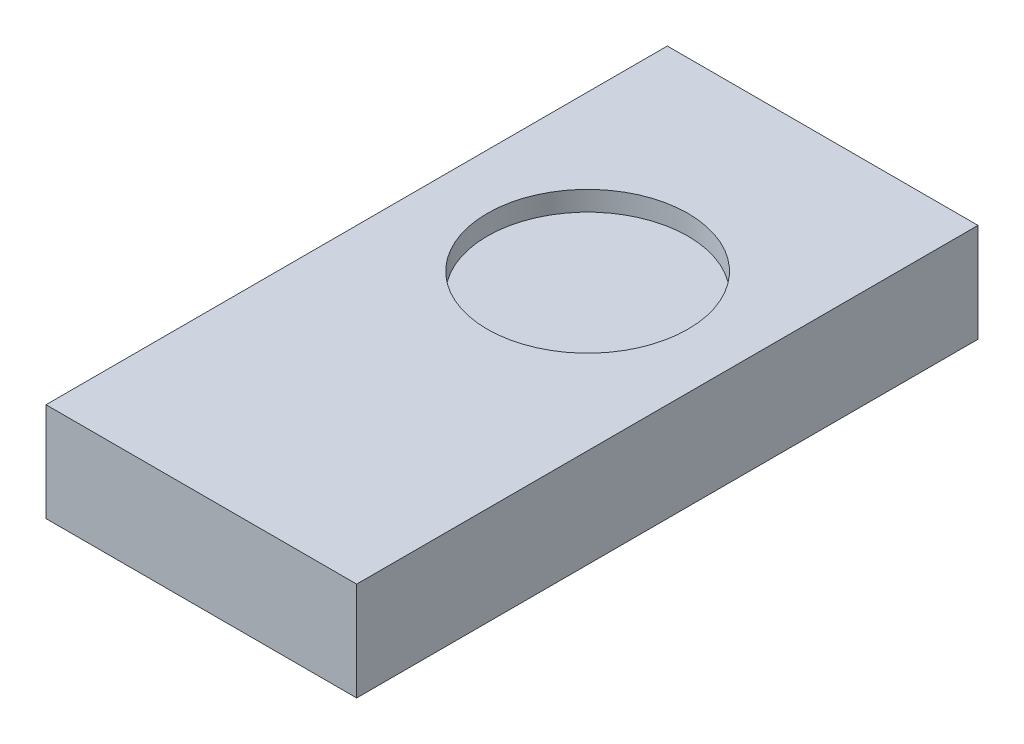
ISO-10303-21;
HEADER;
FILE_DESCRIPTION(('STEP AP214'),'2;1');
FILE_NAME('part.step','',(''),(''),'','','');
FILE_SCHEMA(('AUTOMOTIVE_DESIGN { 1 0 10303 214 1 1 1 1 }'));
ENDSEC;
DATA;
#1=APPLICATION_CONTEXT('core data for automotive mechanical design processes');
#2=APPLICATION_PROTOCOL_DEFINITION('international standard','automotive_design',2000,#1);
#3=PRODUCT_CONTEXT('',#1,'mechanical');
#4=PRODUCT('Part','Part','',(#3));
#5=PRODUCT_RELATED_PRODUCT_CATEGORY('part','',(#4));
#6=PRODUCT_DEFINITION_FORMATION('','',#4);
#7=PRODUCT_DEFINITION_CONTEXT('part definition',#1,'design');
#8=PRODUCT_DEFINITION('design','',#6,#7);
#9=PRODUCT_DEFINITION_SHAPE('','',#8);
#10=(LENGTH_UNIT() NAMED_UNIT(*) SI_UNIT(.MILLI.,.METRE.));
#11=(NAMED_UNIT(*) PLANE_ANGLE_UNIT() SI_UNIT($,.RADIAN.));
#12=(NAMED_UNIT(*) SI_UNIT($,.STERADIAN.) SOLID_ANGLE_UNIT());
#13=UNCERTAINTY_MEASURE_WITH_UNIT(LENGTH_MEASURE(1.E-05),#10,'distance_accuracy_value','');
#14=(GEOMETRIC_REPRESENTATION_CONTEXT(3) GLOBAL_UNCERTAINTY_ASSIGNED_CONTEXT((#13)) GLOBAL_UNIT_ASSIGNED_CONTEXT((#10,
#11,#12)) REPRESENTATION_CONTEXT('',''));
#15=CARTESIAN_POINT('',(0.,0.,0.));
#16=DIRECTION('',(0.,0.,1.));
#17=DIRECTION('',(1.,0.,0.));
#18=AXIS2_PLACEMENT_3D('',#15,#16,#17);
#19=CARTESIAN_POINT('',(0.,3.175,0.));
#20=DIRECTION('',(1.,0.,0.));
#21=DIRECTION('',(0.,0.,-1.));
#22=AXIS2_PLACEMENT_3D('',#19,#20,#21);
#23=PLANE('',#22);
#24=DIRECTION('',(0.,0.,1.));
#25=VECTOR('',#24,1.);
#26=CARTESIAN_POINT('',(0.,0.,0.));
#27=LINE('',#26,#25);
#28=CARTESIAN_POINT('',(0.,0.,-20.));
#29=VERTEX_POINT('',#28);
#30=CARTESIAN_POINT('',(0.,0.,0.));
#31=VERTEX_POINT('',#30);
#32=EDGE_CURVE('E97',#29,#31,#27,.T.);
#33=ORIENTED_EDGE('',*,*,#32,.T.);
#34=DIRECTION('',(0.,-1.,0.));
#35=VECTOR('',#34,1.);
#36=CARTESIAN_POINT('',(0.,3.175,0.));
#37=LINE('',#36,#35);
#38=CARTESIAN_POINT('',(0.,3.175,0.));
#39=VERTEX_POINT('',#38);
#40=EDGE_CURVE('E11',#39,#31,#37,.T.);
#41=ORIENTED_EDGE('',*,*,#40,.F.);
#42=DIRECTION('',(0.,0.,1.));
#43=VECTOR('',#42,1.);
#44=CARTESIAN_POINT('',(0.,3.175,0.));
#45=LINE('',#44,#43);
#46=CARTESIAN_POINT('',(0.,3.175,-20.));
#47=VERTEX_POINT('',#46);
#48=EDGE_CURVE('E85',#47,#39,#45,.T.);
#49=ORIENTED_EDGE('',*,*,#48,.F.);
#50=DIRECTION('',(0.,-1.,0.));
#51=VECTOR('',#50,1.);
#52=CARTESIAN_POINT('',(0.,3.175,-20.));
#53=LINE('',#52,#51);
#54=EDGE_CURVE('E93',#47,#29,#53,.T.);
#55=ORIENTED_EDGE('',*,*,#54,.T.);
#56=EDGE_LOOP('',(#33,#41,#49,#55));
#57=FACE_BOUND('',#56,.T.);
#58=ADVANCED_FACE('F34',(#57),#23,.F.);
#59=CARTESIAN_POINT('',(0.,3.175,0.));
#60=DIRECTION('',(0.,0.,-1.));
#61=DIRECTION('',(-1.,0.,0.));
#62=AXIS2_PLACEMENT_3D('',#59,#60,#61);
#63=PLANE('',#62);
#64=DIRECTION('',(1.,0.,0.));
#65=VECTOR('',#64,1.);
#66=CARTESIAN_POINT('',(0.,0.,0.));
#67=LINE('',#66,#65);
#68=CARTESIAN_POINT('',(10.,0.,0.));
#69=VERTEX_POINT('',#68);
#70=EDGE_CURVE('E89',#31,#69,#67,.T.);
#71=ORIENTED_EDGE('',*,*,#70,.T.);
#72=DIRECTION('',(0.,-1.,0.));
#73=VECTOR('',#72,1.);
#74=CARTESIAN_POINT('',(10.,3.175,0.));
#75=LINE('',#74,#73);
#76=CARTESIAN_POINT('',(10.,3.175,0.));
#77=VERTEX_POINT('',#76);
#78=EDGE_CURVE('E42',#77,#69,#75,.T.);
#79=ORIENTED_EDGE('',*,*,#78,.F.);
#80=DIRECTION('',(1.,0.,0.));
#81=VECTOR('',#80,1.);
#82=CARTESIAN_POINT('',(0.,3.175,0.));
#83=LINE('',#82,#81);
#84=EDGE_CURVE('E80',#39,#77,#83,.T.);
#85=ORIENTED_EDGE('',*,*,#84,.F.);
#86=ORIENTED_EDGE('',*,*,#40,.T.);
#87=EDGE_LOOP('',(#71,#79,#85,#86));
#88=FACE_BOUND('',#87,.T.);
#89=ADVANCED_FACE('F88',(#88),#63,.F.);
#90=CARTESIAN_POINT('',(10.,3.175,0.));
#91=DIRECTION('',(-1.,0.,0.));
#92=DIRECTION('',(0.,0.,1.));
#93=AXIS2_PLACEMENT_3D('',#90,#91,#92);
#94=PLANE('',#93);
#95=DIRECTION('',(0.,0.,-1.));
#96=VECTOR('',#95,1.);
#97=CARTESIAN_POINT('',(10.,0.,0.));
#98=LINE('',#97,#96);
#99=CARTESIAN_POINT('',(10.,0.,-20.));
#100=VERTEX_POINT('',#99);
#101=EDGE_CURVE('E67',#69,#100,#98,.T.);
#102=ORIENTED_EDGE('',*,*,#101,.T.);
#103=DIRECTION('',(0.,-1.,0.));
#104=VECTOR('',#103,1.);
#105=CARTESIAN_POINT('',(10.,3.175,-20.));
#106=LINE('',#105,#104);
#107=CARTESIAN_POINT('',(10.,3.175,-20.));
#108=VERTEX_POINT('',#107);
#109=EDGE_CURVE('E90',#108,#100,#106,.T.);
#110=ORIENTED_EDGE('',*,*,#109,.F.);
#111=DIRECTION('',(0.,0.,-1.));
#112=VECTOR('',#111,1.);
#113=CARTESIAN_POINT('',(10.,3.175,0.));
#114=LINE('',#113,#112);
#115=EDGE_CURVE('E83',#77,#108,#114,.T.);
#116=ORIENTED_EDGE('',*,*,#115,.F.);
#117=ORIENTED_EDGE('',*,*,#78,.T.);
#118=EDGE_LOOP('',(#102,#110,#116,#117));
#119=FACE_BOUND('',#118,.T.);
#120=ADVANCED_FACE('F91',(#119),#94,.F.);
#121=CARTESIAN_POINT('',(0.,3.175,-20.));
#122=DIRECTION('',(0.,0.,1.));
#123=DIRECTION('',(1.,0.,0.));
#124=AXIS2_PLACEMENT_3D('',#121,#122,#123);
#125=PLANE('',#124);
#126=DIRECTION('',(-1.,0.,0.));
#127=VECTOR('',#126,1.);
#128=CARTESIAN_POINT('',(0.,0.,-20.));
#129=LINE('',#128,#127);
#130=EDGE_CURVE('E73',#100,#29,#129,.T.);
#131=ORIENTED_EDGE('',*,*,#130,.T.);
#132=ORIENTED_EDGE('',*,*,#54,.F.);
#133=DIRECTION('',(-1.,0.,0.));
#134=VECTOR('',#133,1.);
#135=CARTESIAN_POINT('',(0.,3.175,-20.));
#136=LINE('',#135,#134);
#137=EDGE_CURVE('E50',#108,#47,#136,.T.);
#138=ORIENTED_EDGE('',*,*,#137,.F.);
#139=ORIENTED_EDGE('',*,*,#109,.T.);
#140=EDGE_LOOP('',(#131,#132,#138,#139));
#141=FACE_BOUND('',#140,.T.);
#142=ADVANCED_FACE('F105',(#141),#125,.F.);
#143=CARTESIAN_POINT('',(0.,3.175,0.));
#144=DIRECTION('',(0.,-1.,0.));
#145=DIRECTION('',(0.,0.,-1.));
#146=AXIS2_PLACEMENT_3D('',#143,#144,#145);
#147=PLANE('',#146);
#148=CARTESIAN_POINT('',(4.99645204685351,3.175,-12.4370248888681));
#149=DIRECTION('',(0.,1.,0.));
#150=DIRECTION('',(0.,0.,1.));
#151=AXIS2_PLACEMENT_3D('',#148,#149,#150);
#152=CIRCLE('',#151,3.23032342055285);
#153=CARTESIAN_POINT('',(4.99645204685351,3.175,-9.20670146831526));
#154=VERTEX_POINT('',#153);
#155=EDGE_CURVE('E111',#154,#154,#152,.T.);
#156=ORIENTED_EDGE('',*,*,#155,.F.);
#157=EDGE_LOOP('',(#156));
#158=FACE_BOUND('',#157,.T.);
#159=ORIENTED_EDGE('',*,*,#48,.T.);
#160=ORIENTED_EDGE('',*,*,#84,.T.);
#161=ORIENTED_EDGE('',*,*,#115,.T.);
#162=ORIENTED_EDGE('',*,*,#137,.T.);
#163=EDGE_LOOP('',(#159,#160,#161,#162));
#164=FACE_BOUND('',#163,.T.);
#165=ADVANCED_FACE('F81',(#158,#164),#147,.F.);
#166=CARTESIAN_POINT('',(0.,0.,0.));
#167=DIRECTION('',(0.,-1.,0.));
#168=DIRECTION('',(0.,0.,-1.));
#169=AXIS2_PLACEMENT_3D('',#166,#167,#168);
#170=PLANE('',#169);
#171=ORIENTED_EDGE('',*,*,#32,.F.);
#172=ORIENTED_EDGE('',*,*,#130,.F.);
#173=ORIENTED_EDGE('',*,*,#101,.F.);
#174=ORIENTED_EDGE('',*,*,#70,.F.);
#175=EDGE_LOOP('',(#171,#172,#173,#174));
#176=FACE_BOUND('',#175,.T.);
#177=ADVANCED_FACE('F108',(#176),#170,.T.);
#178=CARTESIAN_POINT('',(4.99645204685351,2.54,-12.4370248888681));
#179=DIRECTION('',(0.,1.,0.));
#180=DIRECTION('',(0.,0.,1.));
#181=AXIS2_PLACEMENT_3D('',#178,#179,#180);
#182=CYLINDRICAL_SURFACE('',#181,3.23032342055285);
#183=CARTESIAN_POINT('',(4.99645204685351,2.54,-12.4370248888681));
#184=DIRECTION('',(0.,1.,0.));
#185=DIRECTION('',(0.,0.,1.));
#186=AXIS2_PLACEMENT_3D('',#183,#184,#185);
#187=CIRCLE('',#186,3.23032342055285);
#188=CARTESIAN_POINT('',(4.99645204685351,2.54,-9.20670146831526));
#189=VERTEX_POINT('',#188);
#190=EDGE_CURVE('E100',#189,#189,#187,.T.);
#191=ORIENTED_EDGE('',*,*,#190,.F.);
#192=EDGE_LOOP('',(#191));
#193=FACE_BOUND('',#192,.T.);
#194=ORIENTED_EDGE('',*,*,#155,.T.);
#195=EDGE_LOOP('',(#194));
#196=FACE_BOUND('',#195,.T.);
#197=ADVANCED_FACE('F119',(#193,#196),#182,.F.);
#198=CARTESIAN_POINT('',(4.99645204685351,2.54,-12.4370248888681));
#199=DIRECTION('',(0.,1.,0.));
#200=DIRECTION('',(0.,0.,1.));
#201=AXIS2_PLACEMENT_3D('',#198,#199,#200);
#202=PLANE('',#201);
#203=ORIENTED_EDGE('',*,*,#190,.T.);
#204=EDGE_LOOP('',(#203));
#205=FACE_BOUND('',#204,.T.);
#206=ADVANCED_FACE('F117',(#205),#202,.T.);
#207=CLOSED_SHELL('',(#58,#89,#120,#142,#165,#177,#197,#206));
#208=MANIFOLD_SOLID_BREP('B2',#207);
#209=ADVANCED_BREP_SHAPE_REPRESENTATION('',(#18,#208),#14);
#210=SHAPE_DEFINITION_REPRESENTATION(#9,#209);
ENDSEC;
END-ISO-10303-21;
